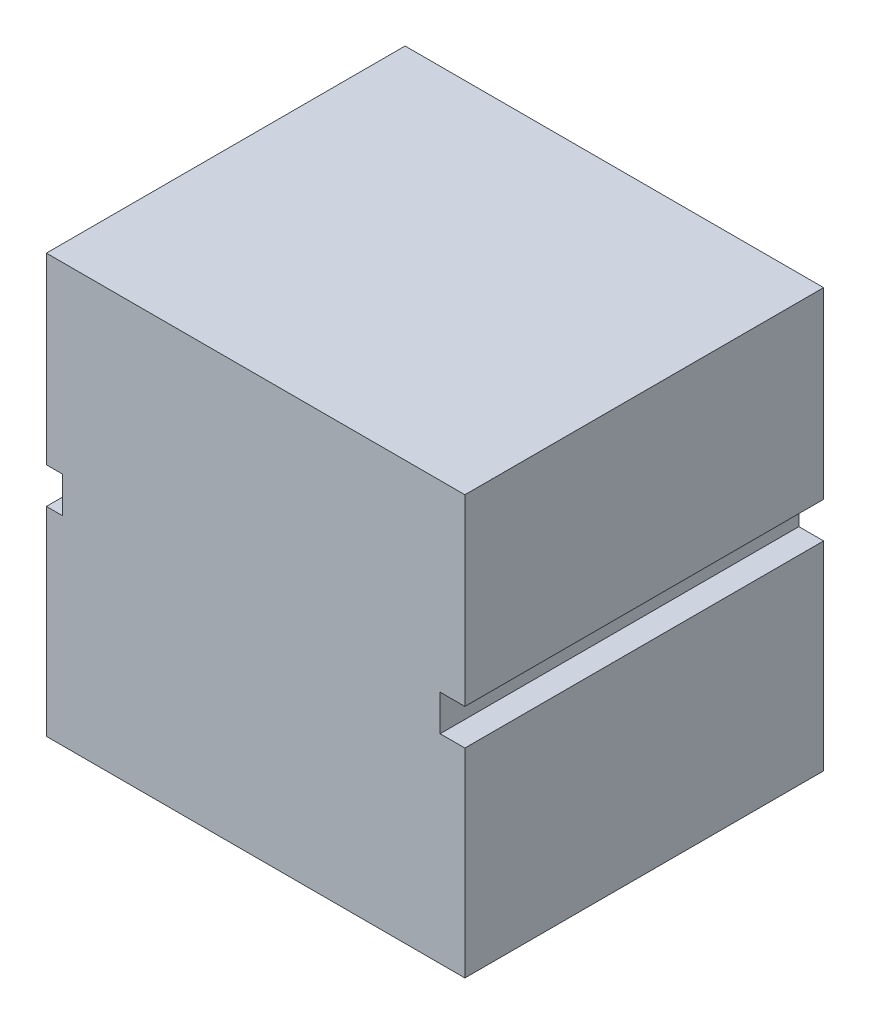
ISO-10303-21;
HEADER;
FILE_DESCRIPTION(('STEP AP214'),'2;1');
FILE_NAME('part.step','',(''),(''),'','','');
FILE_SCHEMA(('AUTOMOTIVE_DESIGN { 1 0 10303 214 1 1 1 1 }'));
ENDSEC;
DATA;
#1=APPLICATION_CONTEXT('core data for automotive mechanical design processes');
#2=APPLICATION_PROTOCOL_DEFINITION('international standard','automotive_design',2000,#1);
#3=PRODUCT_CONTEXT('',#1,'mechanical');
#4=PRODUCT('Part','Part','',(#3));
#5=PRODUCT_RELATED_PRODUCT_CATEGORY('part','',(#4));
#6=PRODUCT_DEFINITION_FORMATION('','',#4);
#7=PRODUCT_DEFINITION_CONTEXT('part definition',#1,'design');
#8=PRODUCT_DEFINITION('design','',#6,#7);
#9=PRODUCT_DEFINITION_SHAPE('','',#8);
#10=(LENGTH_UNIT() NAMED_UNIT(*) SI_UNIT(.MILLI.,.METRE.));
#11=(NAMED_UNIT(*) PLANE_ANGLE_UNIT() SI_UNIT($,.RADIAN.));
#12=(NAMED_UNIT(*) SI_UNIT($,.STERADIAN.) SOLID_ANGLE_UNIT());
#13=UNCERTAINTY_MEASURE_WITH_UNIT(LENGTH_MEASURE(1.E-05),#10,'distance_accuracy_value','');
#14=(GEOMETRIC_REPRESENTATION_CONTEXT(3) GLOBAL_UNCERTAINTY_ASSIGNED_CONTEXT((#13)) GLOBAL_UNIT_ASSIGNED_CONTEXT((#10,
#11,#12)) REPRESENTATION_CONTEXT('',''));
#15=CARTESIAN_POINT('',(0.,0.,0.));
#16=DIRECTION('',(0.,0.,1.));
#17=DIRECTION('',(1.,0.,0.));
#18=AXIS2_PLACEMENT_3D('',#15,#16,#17);
#19=CARTESIAN_POINT('',(0.,0.,6.));
#20=DIRECTION('',(1.,0.,0.));
#21=DIRECTION('',(0.,0.,-1.));
#22=AXIS2_PLACEMENT_3D('',#19,#20,#21);
#23=PLANE('',#22);
#24=DIRECTION('',(0.,-1.,0.));
#25=VECTOR('',#24,1.);
#26=CARTESIAN_POINT('',(0.,0.,6.));
#27=LINE('',#26,#25);
#28=CARTESIAN_POINT('',(0.,3.33100370395474,6.));
#29=VERTEX_POINT('',#28);
#30=CARTESIAN_POINT('',(0.,0.,6.));
#31=VERTEX_POINT('',#30);
#32=EDGE_CURVE('E166',#29,#31,#27,.T.);
#33=ORIENTED_EDGE('',*,*,#32,.F.);
#34=DIRECTION('',(0.,0.,-1.));
#35=VECTOR('',#34,1.);
#36=CARTESIAN_POINT('',(0.,3.33100370395474,6.));
#37=LINE('',#36,#35);
#38=CARTESIAN_POINT('',(0.,3.33100370395474,0.));
#39=VERTEX_POINT('',#38);
#40=EDGE_CURVE('E181',#29,#39,#37,.T.);
#41=ORIENTED_EDGE('',*,*,#40,.T.);
#42=DIRECTION('',(0.,-1.,0.));
#43=VECTOR('',#42,1.);
#44=CARTESIAN_POINT('',(0.,0.,0.));
#45=LINE('',#44,#43);
#46=CARTESIAN_POINT('',(0.,0.,0.));
#47=VERTEX_POINT('',#46);
#48=EDGE_CURVE('E160',#39,#47,#45,.T.);
#49=ORIENTED_EDGE('',*,*,#48,.T.);
#50=DIRECTION('',(0.,0.,-1.));
#51=VECTOR('',#50,1.);
#52=CARTESIAN_POINT('',(0.,0.,6.));
#53=LINE('',#52,#51);
#54=EDGE_CURVE('E11',#31,#47,#53,.T.);
#55=ORIENTED_EDGE('',*,*,#54,.F.);
#56=EDGE_LOOP('',(#33,#41,#49,#55));
#57=FACE_BOUND('',#56,.T.);
#58=ADVANCED_FACE('F35',(#57),#23,.F.);
#59=CARTESIAN_POINT('',(7.,0.,6.));
#60=DIRECTION('',(-1.,0.,0.));
#61=DIRECTION('',(0.,0.,1.));
#62=AXIS2_PLACEMENT_3D('',#59,#60,#61);
#63=PLANE('',#62);
#64=DIRECTION('',(0.,1.,0.));
#65=VECTOR('',#64,1.);
#66=CARTESIAN_POINT('',(7.,0.,6.));
#67=LINE('',#66,#65);
#68=CARTESIAN_POINT('',(7.,3.93351223768139,6.));
#69=VERTEX_POINT('',#68);
#70=CARTESIAN_POINT('',(7.,7.,6.));
#71=VERTEX_POINT('',#70);
#72=EDGE_CURVE('E149',#69,#71,#67,.T.);
#73=ORIENTED_EDGE('',*,*,#72,.F.);
#74=DIRECTION('',(0.,0.,-1.));
#75=VECTOR('',#74,1.);
#76=CARTESIAN_POINT('',(7.,3.93351223768139,6.));
#77=LINE('',#76,#75);
#78=CARTESIAN_POINT('',(7.,3.93351223768139,0.));
#79=VERTEX_POINT('',#78);
#80=EDGE_CURVE('E191',#69,#79,#77,.T.);
#81=ORIENTED_EDGE('',*,*,#80,.T.);
#82=DIRECTION('',(0.,1.,0.));
#83=VECTOR('',#82,1.);
#84=CARTESIAN_POINT('',(7.,0.,0.));
#85=LINE('',#84,#83);
#86=CARTESIAN_POINT('',(7.,7.,0.));
#87=VERTEX_POINT('',#86);
#88=EDGE_CURVE('E162',#79,#87,#85,.T.);
#89=ORIENTED_EDGE('',*,*,#88,.T.);
#90=DIRECTION('',(0.,0.,-1.));
#91=VECTOR('',#90,1.);
#92=CARTESIAN_POINT('',(7.,7.,6.));
#93=LINE('',#92,#91);
#94=EDGE_CURVE('E169',#71,#87,#93,.T.);
#95=ORIENTED_EDGE('',*,*,#94,.F.);
#96=EDGE_LOOP('',(#73,#81,#89,#95));
#97=FACE_BOUND('',#96,.T.);
#98=ADVANCED_FACE('F243',(#97),#63,.F.);
#99=CARTESIAN_POINT('',(0.,7.,0.));
#100=VERTEX_POINT('',#99);
#101=CARTESIAN_POINT('',(0.,3.93351223768139,0.));
#102=VERTEX_POINT('',#101);
#103=EDGE_CURVE('E156',#100,#102,#45,.T.);
#104=ORIENTED_EDGE('',*,*,#103,.T.);
#105=DIRECTION('',(0.,0.,-1.));
#106=VECTOR('',#105,1.);
#107=CARTESIAN_POINT('',(0.,3.93351223768139,6.));
#108=LINE('',#107,#106);
#109=CARTESIAN_POINT('',(0.,3.93351223768139,6.));
#110=VERTEX_POINT('',#109);
#111=EDGE_CURVE('E58',#110,#102,#108,.T.);
#112=ORIENTED_EDGE('',*,*,#111,.F.);
#113=CARTESIAN_POINT('',(0.,7.,6.));
#114=VERTEX_POINT('',#113);
#115=EDGE_CURVE('E216',#114,#110,#27,.T.);
#116=ORIENTED_EDGE('',*,*,#115,.F.);
#117=DIRECTION('',(0.,0.,-1.));
#118=VECTOR('',#117,1.);
#119=CARTESIAN_POINT('',(0.,7.,6.));
#120=LINE('',#119,#118);
#121=EDGE_CURVE('E151',#114,#100,#120,.T.);
#122=ORIENTED_EDGE('',*,*,#121,.T.);
#123=EDGE_LOOP('',(#104,#112,#116,#122));
#124=FACE_BOUND('',#123,.T.);
#125=ADVANCED_FACE('F37',(#124),#23,.F.);
#126=CARTESIAN_POINT('',(0.,0.,6.));
#127=DIRECTION('',(0.,1.,0.));
#128=DIRECTION('',(0.,0.,1.));
#129=AXIS2_PLACEMENT_3D('',#126,#127,#128);
#130=PLANE('',#129);
#131=DIRECTION('',(1.,0.,0.));
#132=VECTOR('',#131,1.);
#133=CARTESIAN_POINT('',(0.,0.,0.));
#134=LINE('',#133,#132);
#135=CARTESIAN_POINT('',(7.,0.,0.));
#136=VERTEX_POINT('',#135);
#137=EDGE_CURVE('E159',#47,#136,#134,.T.);
#138=ORIENTED_EDGE('',*,*,#137,.T.);
#139=DIRECTION('',(0.,0.,-1.));
#140=VECTOR('',#139,1.);
#141=CARTESIAN_POINT('',(7.,0.,6.));
#142=LINE('',#141,#140);
#143=CARTESIAN_POINT('',(7.,0.,6.));
#144=VERTEX_POINT('',#143);
#145=EDGE_CURVE('E43',#144,#136,#142,.T.);
#146=ORIENTED_EDGE('',*,*,#145,.F.);
#147=DIRECTION('',(1.,0.,0.));
#148=VECTOR('',#147,1.);
#149=CARTESIAN_POINT('',(0.,0.,6.));
#150=LINE('',#149,#148);
#151=EDGE_CURVE('E146',#31,#144,#150,.T.);
#152=ORIENTED_EDGE('',*,*,#151,.F.);
#153=ORIENTED_EDGE('',*,*,#54,.T.);
#154=EDGE_LOOP('',(#138,#146,#152,#153));
#155=FACE_BOUND('',#154,.T.);
#156=ADVANCED_FACE('F223',(#155),#130,.F.);
#157=CARTESIAN_POINT('',(7.,3.33100370395474,0.));
#158=VERTEX_POINT('',#157);
#159=EDGE_CURVE('E141',#136,#158,#85,.T.);
#160=ORIENTED_EDGE('',*,*,#159,.T.);
#161=DIRECTION('',(0.,0.,-1.));
#162=VECTOR('',#161,1.);
#163=CARTESIAN_POINT('',(7.,3.33100370395474,6.));
#164=LINE('',#163,#162);
#165=CARTESIAN_POINT('',(7.,3.33100370395474,6.));
#166=VERTEX_POINT('',#165);
#167=EDGE_CURVE('E50',#166,#158,#164,.T.);
#168=ORIENTED_EDGE('',*,*,#167,.F.);
#169=EDGE_CURVE('E139',#144,#166,#67,.T.);
#170=ORIENTED_EDGE('',*,*,#169,.F.);
#171=ORIENTED_EDGE('',*,*,#145,.T.);
#172=EDGE_LOOP('',(#160,#168,#170,#171));
#173=FACE_BOUND('',#172,.T.);
#174=ADVANCED_FACE('F137',(#173),#63,.F.);
#175=CARTESIAN_POINT('',(0.,7.,6.));
#176=DIRECTION('',(0.,-1.,0.));
#177=DIRECTION('',(0.,0.,-1.));
#178=AXIS2_PLACEMENT_3D('',#175,#176,#177);
#179=PLANE('',#178);
#180=DIRECTION('',(-1.,0.,0.));
#181=VECTOR('',#180,1.);
#182=CARTESIAN_POINT('',(0.,7.,0.));
#183=LINE('',#182,#181);
#184=EDGE_CURVE('E164',#87,#100,#183,.T.);
#185=ORIENTED_EDGE('',*,*,#184,.T.);
#186=ORIENTED_EDGE('',*,*,#121,.F.);
#187=DIRECTION('',(-1.,0.,0.));
#188=VECTOR('',#187,1.);
#189=CARTESIAN_POINT('',(0.,7.,6.));
#190=LINE('',#189,#188);
#191=EDGE_CURVE('E148',#71,#114,#190,.T.);
#192=ORIENTED_EDGE('',*,*,#191,.F.);
#193=ORIENTED_EDGE('',*,*,#94,.T.);
#194=EDGE_LOOP('',(#185,#186,#192,#193));
#195=FACE_BOUND('',#194,.T.);
#196=ADVANCED_FACE('F238',(#195),#179,.F.);
#197=CARTESIAN_POINT('',(0.,0.,6.));
#198=DIRECTION('',(0.,0.,-1.));
#199=DIRECTION('',(-1.,0.,0.));
#200=AXIS2_PLACEMENT_3D('',#197,#198,#199);
#201=PLANE('',#200);
#202=DIRECTION('',(0.,1.,0.));
#203=VECTOR('',#202,1.);
#204=CARTESIAN_POINT('',(6.58601931908769,3.93351223768139,6.));
#205=LINE('',#204,#203);
#206=CARTESIAN_POINT('',(6.58601931908769,3.33100370395474,6.));
#207=VERTEX_POINT('',#206);
#208=CARTESIAN_POINT('',(6.58601931908769,3.93351223768139,6.));
#209=VERTEX_POINT('',#208);
#210=EDGE_CURVE('E131',#207,#209,#205,.T.);
#211=ORIENTED_EDGE('',*,*,#210,.T.);
#212=DIRECTION('',(1.,0.,0.));
#213=VECTOR('',#212,1.);
#214=CARTESIAN_POINT('',(7.,3.93351223768139,6.));
#215=LINE('',#214,#213);
#216=EDGE_CURVE('E142',#209,#69,#215,.T.);
#217=ORIENTED_EDGE('',*,*,#216,.T.);
#218=ORIENTED_EDGE('',*,*,#72,.T.);
#219=ORIENTED_EDGE('',*,*,#191,.T.);
#220=ORIENTED_EDGE('',*,*,#115,.T.);
#221=DIRECTION('',(1.,0.,0.));
#222=VECTOR('',#221,1.);
#223=CARTESIAN_POINT('',(0.,3.93351223768139,6.));
#224=LINE('',#223,#222);
#225=CARTESIAN_POINT('',(0.267027380003379,3.93351223768139,6.));
#226=VERTEX_POINT('',#225);
#227=EDGE_CURVE('E197',#110,#226,#224,.T.);
#228=ORIENTED_EDGE('',*,*,#227,.T.);
#229=DIRECTION('',(0.,-1.,0.));
#230=VECTOR('',#229,1.);
#231=CARTESIAN_POINT('',(0.267027380003379,3.93351223768139,6.));
#232=LINE('',#231,#230);
#233=CARTESIAN_POINT('',(0.267027380003379,3.33100370395474,6.));
#234=VERTEX_POINT('',#233);
#235=EDGE_CURVE('E200',#226,#234,#232,.T.);
#236=ORIENTED_EDGE('',*,*,#235,.T.);
#237=DIRECTION('',(-1.,0.,0.));
#238=VECTOR('',#237,1.);
#239=CARTESIAN_POINT('',(0.,3.33100370395474,6.));
#240=LINE('',#239,#238);
#241=EDGE_CURVE('E204',#234,#29,#240,.T.);
#242=ORIENTED_EDGE('',*,*,#241,.T.);
#243=ORIENTED_EDGE('',*,*,#32,.T.);
#244=ORIENTED_EDGE('',*,*,#151,.T.);
#245=ORIENTED_EDGE('',*,*,#169,.T.);
#246=DIRECTION('',(-1.,0.,0.));
#247=VECTOR('',#246,1.);
#248=CARTESIAN_POINT('',(7.,3.33100370395474,6.));
#249=LINE('',#248,#247);
#250=EDGE_CURVE('E124',#166,#207,#249,.T.);
#251=ORIENTED_EDGE('',*,*,#250,.T.);
#252=EDGE_LOOP('',(#211,#217,#218,#219,#220,#228,#236,#242,#243,#244,#245,#251));
#253=FACE_BOUND('',#252,.T.);
#254=ADVANCED_FACE('F144',(#253),#201,.F.);
#255=CARTESIAN_POINT('',(0.,0.,0.));
#256=DIRECTION('',(0.,0.,-1.));
#257=DIRECTION('',(-1.,0.,0.));
#258=AXIS2_PLACEMENT_3D('',#255,#256,#257);
#259=PLANE('',#258);
#260=DIRECTION('',(1.,0.,0.));
#261=VECTOR('',#260,1.);
#262=CARTESIAN_POINT('',(7.,3.93351223768139,0.));
#263=LINE('',#262,#261);
#264=CARTESIAN_POINT('',(6.58601931908769,3.93351223768139,0.));
#265=VERTEX_POINT('',#264);
#266=EDGE_CURVE('E132',#265,#79,#263,.T.);
#267=ORIENTED_EDGE('',*,*,#266,.F.);
#268=DIRECTION('',(0.,1.,0.));
#269=VECTOR('',#268,1.);
#270=CARTESIAN_POINT('',(6.58601931908769,3.93351223768139,0.));
#271=LINE('',#270,#269);
#272=CARTESIAN_POINT('',(6.58601931908769,3.33100370395474,0.));
#273=VERTEX_POINT('',#272);
#274=EDGE_CURVE('E180',#273,#265,#271,.T.);
#275=ORIENTED_EDGE('',*,*,#274,.F.);
#276=DIRECTION('',(-1.,0.,0.));
#277=VECTOR('',#276,1.);
#278=CARTESIAN_POINT('',(7.,3.33100370395474,0.));
#279=LINE('',#278,#277);
#280=EDGE_CURVE('E178',#158,#273,#279,.T.);
#281=ORIENTED_EDGE('',*,*,#280,.F.);
#282=ORIENTED_EDGE('',*,*,#159,.F.);
#283=ORIENTED_EDGE('',*,*,#137,.F.);
#284=ORIENTED_EDGE('',*,*,#48,.F.);
#285=DIRECTION('',(-1.,0.,0.));
#286=VECTOR('',#285,1.);
#287=CARTESIAN_POINT('',(0.,3.33100370395474,0.));
#288=LINE('',#287,#286);
#289=CARTESIAN_POINT('',(0.267027380003379,3.33100370395474,0.));
#290=VERTEX_POINT('',#289);
#291=EDGE_CURVE('E201',#290,#39,#288,.T.);
#292=ORIENTED_EDGE('',*,*,#291,.F.);
#293=DIRECTION('',(0.,-1.,0.));
#294=VECTOR('',#293,1.);
#295=CARTESIAN_POINT('',(0.267027380003379,3.93351223768139,0.));
#296=LINE('',#295,#294);
#297=CARTESIAN_POINT('',(0.267027380003379,3.93351223768139,0.));
#298=VERTEX_POINT('',#297);
#299=EDGE_CURVE('E209',#298,#290,#296,.T.);
#300=ORIENTED_EDGE('',*,*,#299,.F.);
#301=DIRECTION('',(1.,0.,0.));
#302=VECTOR('',#301,1.);
#303=CARTESIAN_POINT('',(0.,3.93351223768139,0.));
#304=LINE('',#303,#302);
#305=EDGE_CURVE('E207',#102,#298,#304,.T.);
#306=ORIENTED_EDGE('',*,*,#305,.F.);
#307=ORIENTED_EDGE('',*,*,#103,.F.);
#308=ORIENTED_EDGE('',*,*,#184,.F.);
#309=ORIENTED_EDGE('',*,*,#88,.F.);
#310=EDGE_LOOP('',(#267,#275,#281,#282,#283,#284,#292,#300,#306,#307,#308,#309));
#311=FACE_BOUND('',#310,.T.);
#312=ADVANCED_FACE('F175',(#311),#259,.T.);
#313=CARTESIAN_POINT('',(0.,3.33100370395474,6.));
#314=DIRECTION('',(0.,-1.,0.));
#315=DIRECTION('',(0.,0.,-1.));
#316=AXIS2_PLACEMENT_3D('',#313,#314,#315);
#317=PLANE('',#316);
#318=ORIENTED_EDGE('',*,*,#291,.T.);
#319=ORIENTED_EDGE('',*,*,#40,.F.);
#320=ORIENTED_EDGE('',*,*,#241,.F.);
#321=DIRECTION('',(0.,0.,-1.));
#322=VECTOR('',#321,1.);
#323=CARTESIAN_POINT('',(0.267027380003379,3.33100370395474,6.));
#324=LINE('',#323,#322);
#325=EDGE_CURVE('E185',#234,#290,#324,.T.);
#326=ORIENTED_EDGE('',*,*,#325,.T.);
#327=EDGE_LOOP('',(#318,#319,#320,#326));
#328=FACE_BOUND('',#327,.T.);
#329=ADVANCED_FACE('F227',(#328),#317,.F.);
#330=CARTESIAN_POINT('',(0.267027380003379,3.93351223768139,6.));
#331=DIRECTION('',(1.,0.,0.));
#332=DIRECTION('',(0.,0.,-1.));
#333=AXIS2_PLACEMENT_3D('',#330,#331,#332);
#334=PLANE('',#333);
#335=ORIENTED_EDGE('',*,*,#299,.T.);
#336=ORIENTED_EDGE('',*,*,#325,.F.);
#337=ORIENTED_EDGE('',*,*,#235,.F.);
#338=DIRECTION('',(0.,0.,-1.));
#339=VECTOR('',#338,1.);
#340=CARTESIAN_POINT('',(0.267027380003379,3.93351223768139,6.));
#341=LINE('',#340,#339);
#342=EDGE_CURVE('E214',#226,#298,#341,.T.);
#343=ORIENTED_EDGE('',*,*,#342,.T.);
#344=EDGE_LOOP('',(#335,#336,#337,#343));
#345=FACE_BOUND('',#344,.T.);
#346=ADVANCED_FACE('F230',(#345),#334,.F.);
#347=CARTESIAN_POINT('',(0.,3.93351223768139,6.));
#348=DIRECTION('',(0.,1.,0.));
#349=DIRECTION('',(0.,0.,1.));
#350=AXIS2_PLACEMENT_3D('',#347,#348,#349);
#351=PLANE('',#350);
#352=ORIENTED_EDGE('',*,*,#305,.T.);
#353=ORIENTED_EDGE('',*,*,#342,.F.);
#354=ORIENTED_EDGE('',*,*,#227,.F.);
#355=ORIENTED_EDGE('',*,*,#111,.T.);
#356=EDGE_LOOP('',(#352,#353,#354,#355));
#357=FACE_BOUND('',#356,.T.);
#358=ADVANCED_FACE('F231',(#357),#351,.F.);
#359=CARTESIAN_POINT('',(7.,3.93351223768139,6.));
#360=DIRECTION('',(0.,1.,0.));
#361=DIRECTION('',(0.,0.,1.));
#362=AXIS2_PLACEMENT_3D('',#359,#360,#361);
#363=PLANE('',#362);
#364=ORIENTED_EDGE('',*,*,#266,.T.);
#365=ORIENTED_EDGE('',*,*,#80,.F.);
#366=ORIENTED_EDGE('',*,*,#216,.F.);
#367=DIRECTION('',(0.,0.,-1.));
#368=VECTOR('',#367,1.);
#369=CARTESIAN_POINT('',(6.58601931908769,3.93351223768139,6.));
#370=LINE('',#369,#368);
#371=EDGE_CURVE('E194',#209,#265,#370,.T.);
#372=ORIENTED_EDGE('',*,*,#371,.T.);
#373=EDGE_LOOP('',(#364,#365,#366,#372));
#374=FACE_BOUND('',#373,.T.);
#375=ADVANCED_FACE('F247',(#374),#363,.F.);
#376=CARTESIAN_POINT('',(6.58601931908769,3.93351223768139,6.));
#377=DIRECTION('',(-1.,0.,0.));
#378=DIRECTION('',(0.,0.,1.));
#379=AXIS2_PLACEMENT_3D('',#376,#377,#378);
#380=PLANE('',#379);
#381=ORIENTED_EDGE('',*,*,#274,.T.);
#382=ORIENTED_EDGE('',*,*,#371,.F.);
#383=ORIENTED_EDGE('',*,*,#210,.F.);
#384=DIRECTION('',(0.,0.,-1.));
#385=VECTOR('',#384,1.);
#386=CARTESIAN_POINT('',(6.58601931908769,3.33100370395474,6.));
#387=LINE('',#386,#385);
#388=EDGE_CURVE('E126',#207,#273,#387,.T.);
#389=ORIENTED_EDGE('',*,*,#388,.T.);
#390=EDGE_LOOP('',(#381,#382,#383,#389));
#391=FACE_BOUND('',#390,.T.);
#392=ADVANCED_FACE('F249',(#391),#380,.F.);
#393=CARTESIAN_POINT('',(7.,3.33100370395474,6.));
#394=DIRECTION('',(0.,-1.,0.));
#395=DIRECTION('',(0.,0.,-1.));
#396=AXIS2_PLACEMENT_3D('',#393,#394,#395);
#397=PLANE('',#396);
#398=ORIENTED_EDGE('',*,*,#280,.T.);
#399=ORIENTED_EDGE('',*,*,#388,.F.);
#400=ORIENTED_EDGE('',*,*,#250,.F.);
#401=ORIENTED_EDGE('',*,*,#167,.T.);
#402=EDGE_LOOP('',(#398,#399,#400,#401));
#403=FACE_BOUND('',#402,.T.);
#404=ADVANCED_FACE('F125',(#403),#397,.F.);
#405=CLOSED_SHELL('',(#58,#98,#125,#156,#174,#196,#254,#312,#329,#346,#358,#375,#392,#404));
#406=MANIFOLD_SOLID_BREP('B2',#405);
#407=ADVANCED_BREP_SHAPE_REPRESENTATION('',(#18,#406),#14);
#408=SHAPE_DEFINITION_REPRESENTATION(#9,#407);
ENDSEC;
END-ISO-10303-21;
